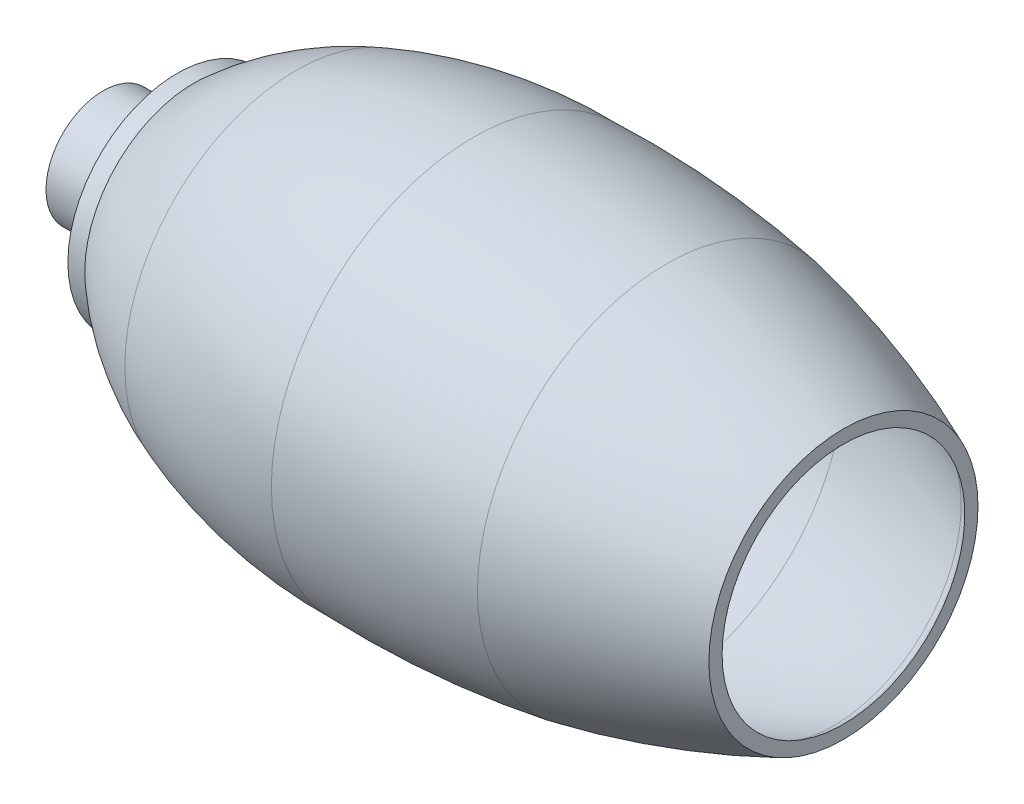
ISO-10303-21;
HEADER;
FILE_DESCRIPTION(('STEP AP214'),'2;1');
FILE_NAME('part.step','',(''),(''),'','','');
FILE_SCHEMA(('AUTOMOTIVE_DESIGN { 1 0 10303 214 1 1 1 1 }'));
ENDSEC;
DATA;
#1=APPLICATION_CONTEXT('core data for automotive mechanical design processes');
#2=APPLICATION_PROTOCOL_DEFINITION('international standard','automotive_design',2000,#1);
#3=PRODUCT_CONTEXT('',#1,'mechanical');
#4=PRODUCT('Part','Part','',(#3));
#5=PRODUCT_RELATED_PRODUCT_CATEGORY('part','',(#4));
#6=PRODUCT_DEFINITION_FORMATION('','',#4);
#7=PRODUCT_DEFINITION_CONTEXT('part definition',#1,'design');
#8=PRODUCT_DEFINITION('design','',#6,#7);
#9=PRODUCT_DEFINITION_SHAPE('','',#8);
#10=(LENGTH_UNIT() NAMED_UNIT(*) SI_UNIT(.MILLI.,.METRE.));
#11=(NAMED_UNIT(*) PLANE_ANGLE_UNIT() SI_UNIT($,.RADIAN.));
#12=(NAMED_UNIT(*) SI_UNIT($,.STERADIAN.) SOLID_ANGLE_UNIT());
#13=UNCERTAINTY_MEASURE_WITH_UNIT(LENGTH_MEASURE(1.E-05),#10,'distance_accuracy_value','');
#14=(GEOMETRIC_REPRESENTATION_CONTEXT(3) GLOBAL_UNCERTAINTY_ASSIGNED_CONTEXT((#13)) GLOBAL_UNIT_ASSIGNED_CONTEXT((#10,
#11,#12)) REPRESENTATION_CONTEXT('',''));
#15=CARTESIAN_POINT('',(0.,0.,0.));
#16=DIRECTION('',(0.,0.,1.));
#17=DIRECTION('',(1.,0.,0.));
#18=AXIS2_PLACEMENT_3D('',#15,#16,#17);
#19=CARTESIAN_POINT('',(0.,76.9929631307767,0.));
#20=DIRECTION('',(1.,0.,0.));
#21=DIRECTION('',(0.,0.,-1.));
#22=AXIS2_PLACEMENT_3D('',#19,#20,#21);
#23=PLANE('',#22);
#24=CARTESIAN_POINT('',(0.,60.0045603617557,0.));
#25=DIRECTION('',(-1.,0.,0.));
#26=DIRECTION('',(0.,0.,1.));
#27=AXIS2_PLACEMENT_3D('',#24,#25,#26);
#28=CIRCLE('',#27,13.988402769021);
#29=CARTESIAN_POINT('',(0.,60.0045603617557,13.988402769021));
#30=VERTEX_POINT('',#29);
#31=EDGE_CURVE('E85',#30,#30,#28,.T.);
#32=ORIENTED_EDGE('',*,*,#31,.F.);
#33=EDGE_LOOP('',(#32));
#34=FACE_BOUND('',#33,.T.);
#35=CARTESIAN_POINT('',(0.,60.0045603617557,0.));
#36=DIRECTION('',(-1.,0.,0.));
#37=DIRECTION('',(0.,0.,1.));
#38=AXIS2_PLACEMENT_3D('',#35,#36,#37);
#39=CIRCLE('',#38,16.988402769021);
#40=CARTESIAN_POINT('',(0.,60.0045603617557,16.988402769021));
#41=VERTEX_POINT('',#40);
#42=EDGE_CURVE('E10',#41,#41,#39,.T.);
#43=ORIENTED_EDGE('',*,*,#42,.T.);
#44=EDGE_LOOP('',(#43));
#45=FACE_BOUND('',#44,.T.);
#46=ADVANCED_FACE('F30',(#34,#45),#23,.F.);
#47=CARTESIAN_POINT('',(0.,60.0045603617557,0.));
#48=DIRECTION('',(-1.,0.,0.));
#49=DIRECTION('',(0.,0.,1.));
#50=AXIS2_PLACEMENT_3D('',#47,#48,#49);
#51=CYLINDRICAL_SURFACE('',#50,16.988402769021);
#52=ORIENTED_EDGE('',*,*,#42,.F.);
#53=EDGE_LOOP('',(#52));
#54=FACE_BOUND('',#53,.T.);
#55=CARTESIAN_POINT('',(12.0032905002227,60.0045603617557,0.));
#56=DIRECTION('',(-1.,0.,0.));
#57=DIRECTION('',(0.,0.,1.));
#58=AXIS2_PLACEMENT_3D('',#55,#56,#57);
#59=CIRCLE('',#58,16.988402769021);
#60=CARTESIAN_POINT('',(12.0032905002227,60.0045603617557,16.988402769021));
#61=VERTEX_POINT('',#60);
#62=EDGE_CURVE('E36',#61,#61,#59,.T.);
#63=ORIENTED_EDGE('',*,*,#62,.T.);
#64=EDGE_LOOP('',(#63));
#65=FACE_BOUND('',#64,.T.);
#66=ADVANCED_FACE('F92',(#54,#65),#51,.T.);
#67=CARTESIAN_POINT('',(21.9988808895101,60.0045603617557,0.));
#68=DIRECTION('',(1.,0.,0.));
#69=DIRECTION('',(0.,0.,-1.));
#70=AXIS2_PLACEMENT_3D('',#67,#68,#69);
#71=CONICAL_SURFACE('',#70,32.4871768751869,0.997995063937663);
#72=ORIENTED_EDGE('',*,*,#62,.F.);
#73=EDGE_LOOP('',(#72));
#74=FACE_BOUND('',#73,.T.);
#75=CARTESIAN_POINT('',(21.9988808895101,60.0045603617557,0.));
#76=DIRECTION('',(-1.,0.,0.));
#77=DIRECTION('',(0.,0.,1.));
#78=AXIS2_PLACEMENT_3D('',#75,#76,#77);
#79=CIRCLE('',#78,32.4871768751869);
#80=CARTESIAN_POINT('',(21.9988808895101,60.0045603617557,32.4871768751869));
#81=VERTEX_POINT('',#80);
#82=EDGE_CURVE('E40',#81,#81,#79,.T.);
#83=ORIENTED_EDGE('',*,*,#82,.T.);
#84=EDGE_LOOP('',(#83));
#85=FACE_BOUND('',#84,.T.);
#86=ADVANCED_FACE('F96',(#74,#85),#71,.T.);
#87=CARTESIAN_POINT('',(0.,60.0045603617557,0.));
#88=DIRECTION('',(-1.,0.,0.));
#89=DIRECTION('',(0.,0.,1.));
#90=AXIS2_PLACEMENT_3D('',#87,#88,#89);
#91=CYLINDRICAL_SURFACE('',#90,32.4871768751869);
#92=ORIENTED_EDGE('',*,*,#82,.F.);
#93=EDGE_LOOP('',(#92));
#94=FACE_BOUND('',#93,.T.);
#95=CARTESIAN_POINT('',(27.0022463099379,60.0045603617557,0.));
#96=DIRECTION('',(-1.,0.,0.));
#97=DIRECTION('',(0.,0.,1.));
#98=AXIS2_PLACEMENT_3D('',#95,#96,#97);
#99=CIRCLE('',#98,32.4871768751869);
#100=CARTESIAN_POINT('',(27.0022463099379,60.0045603617557,32.4871768751869));
#101=VERTEX_POINT('',#100);
#102=EDGE_CURVE('E44',#101,#101,#99,.T.);
#103=ORIENTED_EDGE('',*,*,#102,.T.);
#104=EDGE_LOOP('',(#103));
#105=FACE_BOUND('',#104,.T.);
#106=ADVANCED_FACE('F101',(#94,#105),#91,.T.);
#107=CARTESIAN_POINT('',(90.4803997601018,60.0045603617557,0.));
#108=DIRECTION('',(-1.,0.,0.));
#109=DIRECTION('',(0.,0.,1.));
#110=AXIS2_PLACEMENT_3D('',#107,#108,#109);
#111=DEGENERATE_TOROIDAL_SURFACE('',#110,37.9485717245559,94.8191470445117,.F.);
#112=ORIENTED_EDGE('',*,*,#102,.F.);
#113=EDGE_LOOP('',(#112));
#114=FACE_BOUND('',#113,.T.);
#115=CARTESIAN_POINT('',(57.3094837731343,60.0045603617557,0.));
#116=DIRECTION('',(-1.,0.,0.));
#117=DIRECTION('',(0.,0.,1.));
#118=AXIS2_PLACEMENT_3D('',#115,#116,#117);
#119=CIRCLE('',#118,50.8791321680601);
#120=CARTESIAN_POINT('',(57.3094837731343,60.0045603617557,50.8791321680601));
#121=VERTEX_POINT('',#120);
#122=EDGE_CURVE('E49',#121,#121,#119,.T.);
#123=ORIENTED_EDGE('',*,*,#122,.T.);
#124=EDGE_LOOP('',(#123));
#125=FACE_BOUND('',#124,.T.);
#126=ADVANCED_FACE('F107',(#114,#125),#111,.F.);
#127=CARTESIAN_POINT('',(107.914145789652,60.0045603617557,0.));
#128=DIRECTION('',(-1.,0.,0.));
#129=DIRECTION('',(0.,0.,1.));
#130=AXIS2_PLACEMENT_3D('',#127,#128,#129);
#131=DEGENERATE_TOROIDAL_SURFACE('',#130,84.6340365052216,144.653554058237,.F.);
#132=ORIENTED_EDGE('',*,*,#122,.F.);
#133=EDGE_LOOP('',(#132));
#134=FACE_BOUND('',#133,.T.);
#135=CARTESIAN_POINT('',(109.994289542225,60.0045603617557,0.));
#136=DIRECTION('',(-1.,0.,0.));
#137=DIRECTION('',(0.,0.,1.));
#138=AXIS2_PLACEMENT_3D('',#135,#136,#137);
#139=CIRCLE('',#138,60.0045603617557);
#140=CARTESIAN_POINT('',(109.994289542225,60.0045603617557,60.0045603617557));
#141=VERTEX_POINT('',#140);
#142=EDGE_CURVE('E52',#141,#141,#139,.T.);
#143=ORIENTED_EDGE('',*,*,#142,.T.);
#144=EDGE_LOOP('',(#143));
#145=FACE_BOUND('',#144,.T.);
#146=ADVANCED_FACE('F111',(#134,#145),#131,.F.);
#147=CARTESIAN_POINT('',(119.168943115098,60.0045603617557,0.));
#148=DIRECTION('',(-1.,0.,0.));
#149=DIRECTION('',(0.,0.,1.));
#150=AXIS2_PLACEMENT_3D('',#147,#148,#149);
#151=DEGENERATE_TOROIDAL_SURFACE('',#150,234.177919717025,294.325510028411,.F.);
#152=ORIENTED_EDGE('',*,*,#142,.F.);
#153=EDGE_LOOP('',(#152));
#154=FACE_BOUND('',#153,.T.);
#155=CARTESIAN_POINT('',(167.402005561771,60.0045603617557,0.));
#156=DIRECTION('',(-1.,0.,0.));
#157=DIRECTION('',(0.,0.,1.));
#158=AXIS2_PLACEMENT_3D('',#155,#156,#157);
#159=CIRCLE('',#158,56.1685587195143);
#160=CARTESIAN_POINT('',(167.402005561771,60.0045603617557,56.1685587195143));
#161=VERTEX_POINT('',#160);
#162=EDGE_CURVE('E55',#161,#161,#159,.T.);
#163=ORIENTED_EDGE('',*,*,#162,.T.);
#164=EDGE_LOOP('',(#163));
#165=FACE_BOUND('',#164,.T.);
#166=ADVANCED_FACE('F115',(#154,#165),#151,.F.);
#167=CARTESIAN_POINT('',(116.283784266603,60.0045603617557,0.));
#168=DIRECTION('',(-1.,0.,0.));
#169=DIRECTION('',(0.,0.,1.));
#170=AXIS2_PLACEMENT_3D('',#167,#168,#169);
#171=DEGENERATE_TOROIDAL_SURFACE('',#170,203.525017169243,264.676832961012,.F.);
#172=ORIENTED_EDGE('',*,*,#162,.F.);
#173=EDGE_LOOP('',(#172));
#174=FACE_BOUND('',#173,.T.);
#175=CARTESIAN_POINT('',(219.988579084449,60.0045603617557,0.));
#176=DIRECTION('',(-1.,0.,0.));
#177=DIRECTION('',(0.,0.,1.));
#178=AXIS2_PLACEMENT_3D('',#175,#176,#177);
#179=CIRCLE('',#178,39.9891332164376);
#180=CARTESIAN_POINT('',(219.988579084449,60.0045603617557,39.9891332164376));
#181=VERTEX_POINT('',#180);
#182=EDGE_CURVE('E58',#181,#181,#179,.T.);
#183=ORIENTED_EDGE('',*,*,#182,.T.);
#184=EDGE_LOOP('',(#183));
#185=FACE_BOUND('',#184,.T.);
#186=ADVANCED_FACE('F119',(#174,#185),#171,.F.);
#187=CARTESIAN_POINT('',(219.988579084449,96.0676556008309,0.));
#188=DIRECTION('',(-1.,0.,0.));
#189=DIRECTION('',(0.,0.,1.));
#190=AXIS2_PLACEMENT_3D('',#187,#188,#189);
#191=PLANE('',#190);
#192=ORIENTED_EDGE('',*,*,#182,.F.);
#193=EDGE_LOOP('',(#192));
#194=FACE_BOUND('',#193,.T.);
#195=CARTESIAN_POINT('',(219.988579084449,60.0045603617557,0.));
#196=DIRECTION('',(-1.,0.,0.));
#197=DIRECTION('',(0.,0.,1.));
#198=AXIS2_PLACEMENT_3D('',#195,#196,#197);
#199=CIRCLE('',#198,36.0630952390752);
#200=CARTESIAN_POINT('',(219.988579084449,60.0045603617557,36.0630952390752));
#201=VERTEX_POINT('',#200);
#202=EDGE_CURVE('E61',#201,#201,#199,.T.);
#203=ORIENTED_EDGE('',*,*,#202,.T.);
#204=EDGE_LOOP('',(#203));
#205=FACE_BOUND('',#204,.T.);
#206=ADVANCED_FACE('F123',(#194,#205),#191,.F.);
#207=CARTESIAN_POINT('',(213.575733627387,60.0045603617557,0.));
#208=DIRECTION('',(-1.,0.,0.));
#209=DIRECTION('',(0.,0.,1.));
#210=AXIS2_PLACEMENT_3D('',#207,#208,#209);
#211=TOROIDAL_SURFACE('',#210,29.4128196584961,9.23854708023984);
#212=ORIENTED_EDGE('',*,*,#202,.F.);
#213=EDGE_LOOP('',(#212));
#214=FACE_BOUND('',#213,.T.);
#215=CARTESIAN_POINT('',(216.988579084449,60.0045603617557,0.));
#216=DIRECTION('',(-1.,0.,0.));
#217=DIRECTION('',(0.,0.,1.));
#218=AXIS2_PLACEMENT_3D('',#215,#216,#217);
#219=CIRCLE('',#218,37.9978786588769);
#220=CARTESIAN_POINT('',(216.988579084449,60.0045603617557,37.9978786588769));
#221=VERTEX_POINT('',#220);
#222=EDGE_CURVE('E64',#221,#221,#219,.T.);
#223=ORIENTED_EDGE('',*,*,#222,.T.);
#224=EDGE_LOOP('',(#223));
#225=FACE_BOUND('',#224,.T.);
#226=ADVANCED_FACE('F127',(#214,#225),#211,.F.);
#227=CARTESIAN_POINT('',(116.283784266603,60.0045603617557,0.));
#228=DIRECTION('',(-1.,0.,0.));
#229=DIRECTION('',(0.,0.,1.));
#230=AXIS2_PLACEMENT_3D('',#227,#228,#229);
#231=DEGENERATE_TOROIDAL_SURFACE('',#230,203.525017169243,261.676832961012,.F.);
#232=ORIENTED_EDGE('',*,*,#222,.F.);
#233=EDGE_LOOP('',(#232));
#234=FACE_BOUND('',#233,.T.);
#235=CARTESIAN_POINT('',(166.866357242483,60.0045603617557,0.));
#236=DIRECTION('',(-1.,0.,0.));
#237=DIRECTION('',(0.,0.,1.));
#238=AXIS2_PLACEMENT_3D('',#235,#236,#237);
#239=CIRCLE('',#238,53.216425180147);
#240=CARTESIAN_POINT('',(166.866357242483,60.0045603617557,53.216425180147));
#241=VERTEX_POINT('',#240);
#242=EDGE_CURVE('E67',#241,#241,#239,.T.);
#243=ORIENTED_EDGE('',*,*,#242,.T.);
#244=EDGE_LOOP('',(#243));
#245=FACE_BOUND('',#244,.T.);
#246=ADVANCED_FACE('F131',(#234,#245),#231,.T.);
#247=CARTESIAN_POINT('',(119.168943115098,60.0045603617557,0.));
#248=DIRECTION('',(-1.,0.,0.));
#249=DIRECTION('',(0.,0.,1.));
#250=AXIS2_PLACEMENT_3D('',#247,#248,#249);
#251=DEGENERATE_TOROIDAL_SURFACE('',#250,234.177919717025,291.325510028411,.F.);
#252=ORIENTED_EDGE('',*,*,#242,.F.);
#253=EDGE_LOOP('',(#252));
#254=FACE_BOUND('',#253,.T.);
#255=CARTESIAN_POINT('',(110.019307059088,60.0045603617557,0.));
#256=DIRECTION('',(-1.,0.,0.));
#257=DIRECTION('',(0.,0.,1.));
#258=AXIS2_PLACEMENT_3D('',#255,#256,#257);
#259=CIRCLE('',#258,57.0038739331903);
#260=CARTESIAN_POINT('',(110.019307059088,60.0045603617557,57.0038739331903));
#261=VERTEX_POINT('',#260);
#262=EDGE_CURVE('E70',#261,#261,#259,.T.);
#263=ORIENTED_EDGE('',*,*,#262,.T.);
#264=EDGE_LOOP('',(#263));
#265=FACE_BOUND('',#264,.T.);
#266=ADVANCED_FACE('F135',(#254,#265),#251,.T.);
#267=CARTESIAN_POINT('',(107.914145789652,60.0045603617557,0.));
#268=DIRECTION('',(-1.,0.,0.));
#269=DIRECTION('',(0.,0.,1.));
#270=AXIS2_PLACEMENT_3D('',#267,#268,#269);
#271=DEGENERATE_TOROIDAL_SURFACE('',#270,84.6340365052216,141.653554058237,.F.);
#272=ORIENTED_EDGE('',*,*,#262,.F.);
#273=EDGE_LOOP('',(#272));
#274=FACE_BOUND('',#273,.T.);
#275=CARTESIAN_POINT('',(58.3589843335452,60.0045603617557,0.));
#276=DIRECTION('',(-1.,0.,0.));
#277=DIRECTION('',(0.,0.,1.));
#278=AXIS2_PLACEMENT_3D('',#275,#276,#277);
#279=CIRCLE('',#278,48.0686965125617);
#280=CARTESIAN_POINT('',(58.3589843335452,60.0045603617557,48.0686965125617));
#281=VERTEX_POINT('',#280);
#282=EDGE_CURVE('E73',#281,#281,#279,.T.);
#283=ORIENTED_EDGE('',*,*,#282,.T.);
#284=EDGE_LOOP('',(#283));
#285=FACE_BOUND('',#284,.T.);
#286=ADVANCED_FACE('F139',(#274,#285),#271,.T.);
#287=CARTESIAN_POINT('',(90.4803997601018,60.0045603617557,0.));
#288=DIRECTION('',(-1.,0.,0.));
#289=DIRECTION('',(0.,0.,1.));
#290=AXIS2_PLACEMENT_3D('',#287,#288,#289);
#291=DEGENERATE_TOROIDAL_SURFACE('',#290,37.9485717245559,91.8191470445117,.F.);
#292=ORIENTED_EDGE('',*,*,#282,.F.);
#293=EDGE_LOOP('',(#292));
#294=FACE_BOUND('',#293,.T.);
#295=CARTESIAN_POINT('',(28.1652685737363,60.0045603617557,0.));
#296=DIRECTION('',(-1.,0.,0.));
#297=DIRECTION('',(0.,0.,1.));
#298=AXIS2_PLACEMENT_3D('',#295,#296,#297);
#299=CIRCLE('',#298,29.4871768751869);
#300=CARTESIAN_POINT('',(28.1652685737363,60.0045603617557,29.4871768751869));
#301=VERTEX_POINT('',#300);
#302=EDGE_CURVE('E76',#301,#301,#299,.T.);
#303=ORIENTED_EDGE('',*,*,#302,.T.);
#304=EDGE_LOOP('',(#303));
#305=FACE_BOUND('',#304,.T.);
#306=ADVANCED_FACE('F143',(#294,#305),#291,.T.);
#307=CARTESIAN_POINT('',(0.,60.0045603617557,0.));
#308=DIRECTION('',(-1.,0.,0.));
#309=DIRECTION('',(0.,0.,1.));
#310=AXIS2_PLACEMENT_3D('',#307,#308,#309);
#311=CYLINDRICAL_SURFACE('',#310,29.4871768751869);
#312=ORIENTED_EDGE('',*,*,#302,.F.);
#313=EDGE_LOOP('',(#312));
#314=FACE_BOUND('',#313,.T.);
#315=CARTESIAN_POINT('',(23.6338855420649,60.0045603617557,0.));
#316=DIRECTION('',(-1.,0.,0.));
#317=DIRECTION('',(0.,0.,1.));
#318=AXIS2_PLACEMENT_3D('',#315,#316,#317);
#319=CIRCLE('',#318,29.4871768751869);
#320=CARTESIAN_POINT('',(23.6338855420649,60.0045603617557,29.4871768751869));
#321=VERTEX_POINT('',#320);
#322=EDGE_CURVE('E79',#321,#321,#319,.T.);
#323=ORIENTED_EDGE('',*,*,#322,.T.);
#324=EDGE_LOOP('',(#323));
#325=FACE_BOUND('',#324,.T.);
#326=ADVANCED_FACE('F147',(#314,#325),#311,.F.);
#327=CARTESIAN_POINT('',(13.6382951527776,60.0045603617557,0.));
#328=DIRECTION('',(1.,0.,0.));
#329=DIRECTION('',(0.,0.,-1.));
#330=AXIS2_PLACEMENT_3D('',#327,#328,#329);
#331=CONICAL_SURFACE('',#330,13.988402769021,0.997995063937663);
#332=ORIENTED_EDGE('',*,*,#322,.F.);
#333=EDGE_LOOP('',(#332));
#334=FACE_BOUND('',#333,.T.);
#335=CARTESIAN_POINT('',(13.6382951527776,60.0045603617557,0.));
#336=DIRECTION('',(-1.,0.,0.));
#337=DIRECTION('',(0.,0.,1.));
#338=AXIS2_PLACEMENT_3D('',#335,#336,#337);
#339=CIRCLE('',#338,13.988402769021);
#340=CARTESIAN_POINT('',(13.6382951527776,60.0045603617557,13.988402769021));
#341=VERTEX_POINT('',#340);
#342=EDGE_CURVE('E82',#341,#341,#339,.T.);
#343=ORIENTED_EDGE('',*,*,#342,.T.);
#344=EDGE_LOOP('',(#343));
#345=FACE_BOUND('',#344,.T.);
#346=ADVANCED_FACE('F151',(#334,#345),#331,.F.);
#347=CARTESIAN_POINT('',(0.,60.0045603617557,0.));
#348=DIRECTION('',(-1.,0.,0.));
#349=DIRECTION('',(0.,0.,1.));
#350=AXIS2_PLACEMENT_3D('',#347,#348,#349);
#351=CYLINDRICAL_SURFACE('',#350,13.988402769021);
#352=ORIENTED_EDGE('',*,*,#342,.F.);
#353=EDGE_LOOP('',(#352));
#354=FACE_BOUND('',#353,.T.);
#355=ORIENTED_EDGE('',*,*,#31,.T.);
#356=EDGE_LOOP('',(#355));
#357=FACE_BOUND('',#356,.T.);
#358=ADVANCED_FACE('F89',(#354,#357),#351,.F.);
#359=CLOSED_SHELL('',(#46,#66,#86,#106,#126,#146,#166,#186,#206,#226,#246,#266,#286,#306,#326,
#346,#358));
#360=MANIFOLD_SOLID_BREP('B2',#359);
#361=ADVANCED_BREP_SHAPE_REPRESENTATION('',(#18,#360),#14);
#362=SHAPE_DEFINITION_REPRESENTATION(#9,#361);
ENDSEC;
END-ISO-10303-21;
